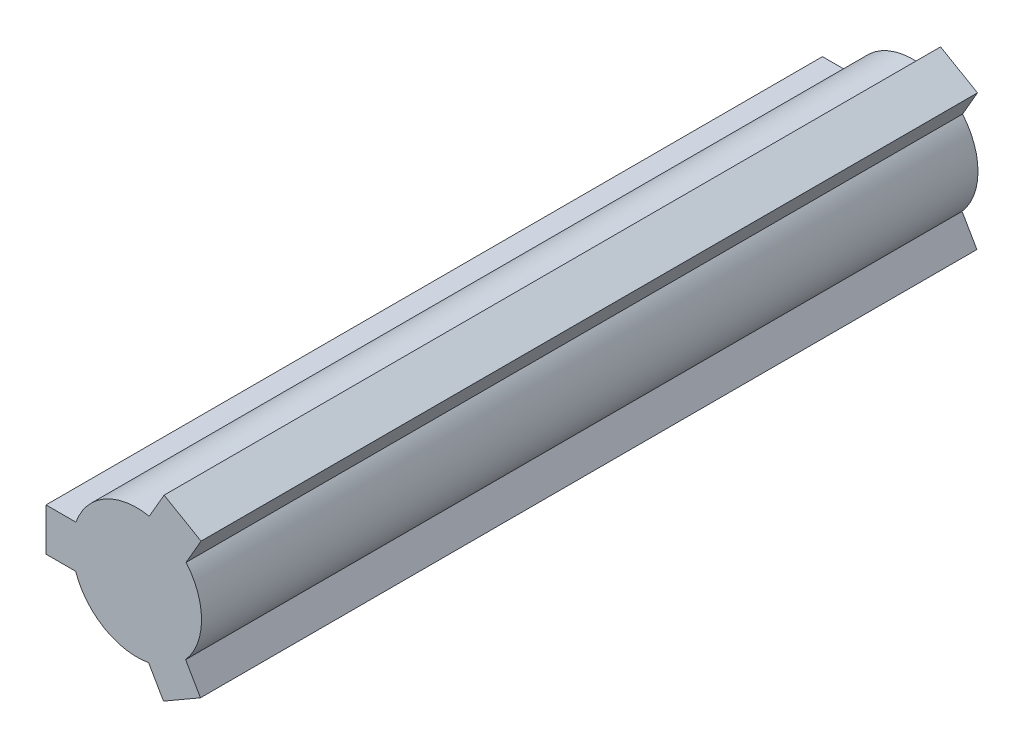
ISO-10303-21;
HEADER;
FILE_DESCRIPTION(('STEP AP214'),'2;1');
FILE_NAME('part.step','',(''),(''),'','','');
FILE_SCHEMA(('AUTOMOTIVE_DESIGN { 1 0 10303 214 1 1 1 1 }'));
ENDSEC;
DATA;
#1=APPLICATION_CONTEXT('core data for automotive mechanical design processes');
#2=APPLICATION_PROTOCOL_DEFINITION('international standard','automotive_design',2000,#1);
#3=PRODUCT_CONTEXT('',#1,'mechanical');
#4=PRODUCT('Part','Part','',(#3));
#5=PRODUCT_RELATED_PRODUCT_CATEGORY('part','',(#4));
#6=PRODUCT_DEFINITION_FORMATION('','',#4);
#7=PRODUCT_DEFINITION_CONTEXT('part definition',#1,'design');
#8=PRODUCT_DEFINITION('design','',#6,#7);
#9=PRODUCT_DEFINITION_SHAPE('','',#8);
#10=(LENGTH_UNIT() NAMED_UNIT(*) SI_UNIT(.MILLI.,.METRE.));
#11=(NAMED_UNIT(*) PLANE_ANGLE_UNIT() SI_UNIT($,.RADIAN.));
#12=(NAMED_UNIT(*) SI_UNIT($,.STERADIAN.) SOLID_ANGLE_UNIT());
#13=UNCERTAINTY_MEASURE_WITH_UNIT(LENGTH_MEASURE(1.E-05),#10,'distance_accuracy_value','');
#14=(GEOMETRIC_REPRESENTATION_CONTEXT(3) GLOBAL_UNCERTAINTY_ASSIGNED_CONTEXT((#13)) GLOBAL_UNIT_ASSIGNED_CONTEXT((#10,
#11,#12)) REPRESENTATION_CONTEXT('',''));
#15=CARTESIAN_POINT('',(0.,0.,0.));
#16=DIRECTION('',(0.,0.,1.));
#17=DIRECTION('',(1.,0.,0.));
#18=AXIS2_PLACEMENT_3D('',#15,#16,#17);
#19=CARTESIAN_POINT('',(0.,0.,38.1));
#20=DIRECTION('',(0.,0.,-1.));
#21=DIRECTION('',(-1.,0.,0.));
#22=AXIS2_PLACEMENT_3D('',#19,#20,#21);
#23=CYLINDRICAL_SURFACE('',#22,3.175);
#24=CARTESIAN_POINT('',(0.,0.,0.));
#25=DIRECTION('',(0.,0.,1.));
#26=DIRECTION('',(1.,0.,0.));
#27=AXIS2_PLACEMENT_3D('',#24,#25,#26);
#28=CIRCLE('',#27,3.175);
#29=CARTESIAN_POINT('',(2.39368220735377,-2.08588362335917,0.));
#30=VERTEX_POINT('',#29);
#31=CARTESIAN_POINT('',(2.41696213486975,2.05886353083585,0.));
#32=VERTEX_POINT('',#31);
#33=EDGE_CURVE('E157',#30,#32,#28,.T.);
#34=ORIENTED_EDGE('',*,*,#33,.T.);
#35=DIRECTION('',(0.,0.,-1.));
#36=VECTOR('',#35,1.);
#37=CARTESIAN_POINT('',(2.41696213486975,2.05886353083585,38.1));
#38=LINE('',#37,#36);
#39=CARTESIAN_POINT('',(2.41696213486975,2.05886353083585,38.1));
#40=VERTEX_POINT('',#39);
#41=EDGE_CURVE('E11',#40,#32,#38,.T.);
#42=ORIENTED_EDGE('',*,*,#41,.F.);
#43=CARTESIAN_POINT('',(0.,0.,38.1));
#44=DIRECTION('',(0.,0.,1.));
#45=DIRECTION('',(1.,0.,0.));
#46=AXIS2_PLACEMENT_3D('',#43,#44,#45);
#47=CIRCLE('',#46,3.175);
#48=CARTESIAN_POINT('',(2.39368220735377,-2.08588362335917,38.1));
#49=VERTEX_POINT('',#48);
#50=EDGE_CURVE('E179',#49,#40,#47,.T.);
#51=ORIENTED_EDGE('',*,*,#50,.F.);
#52=DIRECTION('',(0.,0.,-1.));
#53=VECTOR('',#52,1.);
#54=CARTESIAN_POINT('',(2.39368220735377,-2.08588362335917,38.1));
#55=LINE('',#54,#53);
#56=EDGE_CURVE('E153',#49,#30,#55,.T.);
#57=ORIENTED_EDGE('',*,*,#56,.T.);
#58=EDGE_LOOP('',(#34,#42,#51,#57));
#59=FACE_BOUND('',#58,.T.);
#60=ADVANCED_FACE('F37',(#59),#23,.T.);
#61=CARTESIAN_POINT('',(2.41696213486975,2.05886353083585,38.1));
#62=DIRECTION('',(-0.866025403784438,0.5,0.));
#63=DIRECTION('',(-0.5,-0.866025403784438,0.));
#64=AXIS2_PLACEMENT_3D('',#61,#62,#63);
#65=PLANE('',#64);
#66=DIRECTION('',(0.5,0.866025403784438,0.));
#67=VECTOR('',#66,1.);
#68=CARTESIAN_POINT('',(2.41696213486975,2.05886353083585,0.));
#69=LINE('',#68,#67);
#70=CARTESIAN_POINT('',(3.1501433002469,3.32877056042162,0.));
#71=VERTEX_POINT('',#70);
#72=EDGE_CURVE('E160',#32,#71,#69,.T.);
#73=ORIENTED_EDGE('',*,*,#72,.T.);
#74=DIRECTION('',(0.,0.,-1.));
#75=VECTOR('',#74,1.);
#76=CARTESIAN_POINT('',(3.1501433002469,3.32877056042162,38.1));
#77=LINE('',#76,#75);
#78=CARTESIAN_POINT('',(3.1501433002469,3.32877056042162,38.1));
#79=VERTEX_POINT('',#78);
#80=EDGE_CURVE('E45',#79,#71,#77,.T.);
#81=ORIENTED_EDGE('',*,*,#80,.F.);
#82=DIRECTION('',(0.5,0.866025403784438,0.));
#83=VECTOR('',#82,1.);
#84=CARTESIAN_POINT('',(2.41696213486975,2.05886353083585,38.1));
#85=LINE('',#84,#83);
#86=EDGE_CURVE('E108',#40,#79,#85,.T.);
#87=ORIENTED_EDGE('',*,*,#86,.F.);
#88=ORIENTED_EDGE('',*,*,#41,.T.);
#89=EDGE_LOOP('',(#73,#81,#87,#88));
#90=FACE_BOUND('',#89,.T.);
#91=ADVANCED_FACE('F257',(#90),#65,.F.);
#92=CARTESIAN_POINT('',(3.1501433002469,3.32877056042162,38.1));
#93=DIRECTION('',(-0.5,-0.866025403784439,0.));
#94=DIRECTION('',(0.866025403784439,-0.5,0.));
#95=AXIS2_PLACEMENT_3D('',#92,#93,#94);
#96=PLANE('',#95);
#97=DIRECTION('',(-0.866025403784439,0.5,0.));
#98=VECTOR('',#97,1.);
#99=CARTESIAN_POINT('',(3.1501433002469,3.32877056042162,0.));
#100=LINE('',#99,#98);
#101=CARTESIAN_POINT('',(1.33688820747733,4.37565387634159,0.));
#102=VERTEX_POINT('',#101);
#103=EDGE_CURVE('E162',#71,#102,#100,.T.);
#104=ORIENTED_EDGE('',*,*,#103,.T.);
#105=DIRECTION('',(0.,0.,-1.));
#106=VECTOR('',#105,1.);
#107=CARTESIAN_POINT('',(1.33688820747733,4.37565387634159,38.1));
#108=LINE('',#107,#106);
#109=CARTESIAN_POINT('',(1.33688820747733,4.37565387634159,38.1));
#110=VERTEX_POINT('',#109);
#111=EDGE_CURVE('E198',#110,#102,#108,.T.);
#112=ORIENTED_EDGE('',*,*,#111,.F.);
#113=DIRECTION('',(-0.866025403784439,0.5,0.));
#114=VECTOR('',#113,1.);
#115=CARTESIAN_POINT('',(3.1501433002469,3.32877056042162,38.1));
#116=LINE('',#115,#114);
#117=EDGE_CURVE('E206',#79,#110,#116,.T.);
#118=ORIENTED_EDGE('',*,*,#117,.F.);
#119=ORIENTED_EDGE('',*,*,#80,.T.);
#120=EDGE_LOOP('',(#104,#112,#118,#119));
#121=FACE_BOUND('',#120,.T.);
#122=ADVANCED_FACE('F204',(#121),#96,.F.);
#123=CARTESIAN_POINT('',(1.33688820747733,4.37565387634159,38.1));
#124=DIRECTION('',(0.866025403784438,-0.500000000000001,0.));
#125=DIRECTION('',(0.500000000000001,0.866025403784438,0.));
#126=AXIS2_PLACEMENT_3D('',#123,#124,#125);
#127=PLANE('',#126);
#128=DIRECTION('',(-0.500000000000001,-0.866025403784438,0.));
#129=VECTOR('',#128,1.);
#130=CARTESIAN_POINT('',(1.33688820747733,4.37565387634159,0.));
#131=LINE('',#130,#129);
#132=CARTESIAN_POINT('',(0.609587103490092,3.11593141183476,0.));
#133=VERTEX_POINT('',#132);
#134=EDGE_CURVE('E164',#102,#133,#131,.T.);
#135=ORIENTED_EDGE('',*,*,#134,.T.);
#136=DIRECTION('',(0.,0.,-1.));
#137=VECTOR('',#136,1.);
#138=CARTESIAN_POINT('',(0.609587103490092,3.11593141183476,38.1));
#139=LINE('',#138,#137);
#140=CARTESIAN_POINT('',(0.609587103490092,3.11593141183476,38.1));
#141=VERTEX_POINT('',#140);
#142=EDGE_CURVE('E195',#141,#133,#139,.T.);
#143=ORIENTED_EDGE('',*,*,#142,.F.);
#144=DIRECTION('',(-0.500000000000001,-0.866025403784438,0.));
#145=VECTOR('',#144,1.);
#146=CARTESIAN_POINT('',(1.33688820747733,4.37565387634159,38.1));
#147=LINE('',#146,#145);
#148=EDGE_CURVE('E224',#110,#141,#147,.T.);
#149=ORIENTED_EDGE('',*,*,#148,.F.);
#150=ORIENTED_EDGE('',*,*,#111,.T.);
#151=EDGE_LOOP('',(#135,#143,#149,#150));
#152=FACE_BOUND('',#151,.T.);
#153=ADVANCED_FACE('F215',(#152),#127,.F.);
#154=CARTESIAN_POINT('',(0.,0.,38.1));
#155=DIRECTION('',(0.,0.,-1.));
#156=DIRECTION('',(-1.,0.,0.));
#157=AXIS2_PLACEMENT_3D('',#154,#155,#156);
#158=CYLINDRICAL_SURFACE('',#157,3.175);
#159=CARTESIAN_POINT('',(0.,0.,0.));
#160=DIRECTION('',(0.,0.,1.));
#161=DIRECTION('',(1.,0.,0.));
#162=AXIS2_PLACEMENT_3D('',#159,#160,#161);
#163=CIRCLE('',#162,3.175);
#164=CARTESIAN_POINT('',(-2.99150918806405,1.06371884336435,0.));
#165=VERTEX_POINT('',#164);
#166=EDGE_CURVE('E166',#133,#165,#163,.T.);
#167=ORIENTED_EDGE('',*,*,#166,.T.);
#168=DIRECTION('',(0.,0.,-1.));
#169=VECTOR('',#168,1.);
#170=CARTESIAN_POINT('',(-2.99150918806405,1.06371884336435,38.1));
#171=LINE('',#170,#169);
#172=CARTESIAN_POINT('',(-2.99150918806405,1.06371884336435,38.1));
#173=VERTEX_POINT('',#172);
#174=EDGE_CURVE('E192',#173,#165,#171,.T.);
#175=ORIENTED_EDGE('',*,*,#174,.F.);
#176=CARTESIAN_POINT('',(0.,0.,38.1));
#177=DIRECTION('',(0.,0.,1.));
#178=DIRECTION('',(1.,0.,0.));
#179=AXIS2_PLACEMENT_3D('',#176,#177,#178);
#180=CIRCLE('',#179,3.175);
#181=EDGE_CURVE('E221',#141,#173,#180,.T.);
#182=ORIENTED_EDGE('',*,*,#181,.F.);
#183=ORIENTED_EDGE('',*,*,#142,.T.);
#184=EDGE_LOOP('',(#167,#175,#182,#183));
#185=FACE_BOUND('',#184,.T.);
#186=ADVANCED_FACE('F219',(#185),#158,.T.);
#187=CARTESIAN_POINT('',(-2.99150918806405,1.06371884336435,38.1));
#188=DIRECTION('',(0.,-1.,0.));
#189=DIRECTION('',(1.,0.,0.));
#190=AXIS2_PLACEMENT_3D('',#187,#188,#189);
#191=PLANE('',#190);
#192=DIRECTION('',(-1.,0.,0.));
#193=VECTOR('',#192,1.);
#194=CARTESIAN_POINT('',(-2.99150918806405,1.06371884336435,0.));
#195=LINE('',#194,#193);
#196=CARTESIAN_POINT('',(-4.45787151881833,1.06371884336435,0.));
#197=VERTEX_POINT('',#196);
#198=EDGE_CURVE('E168',#165,#197,#195,.T.);
#199=ORIENTED_EDGE('',*,*,#198,.T.);
#200=DIRECTION('',(0.,0.,-1.));
#201=VECTOR('',#200,1.);
#202=CARTESIAN_POINT('',(-4.45787151881833,1.06371884336435,38.1));
#203=LINE('',#202,#201);
#204=CARTESIAN_POINT('',(-4.45787151881833,1.06371884336435,38.1));
#205=VERTEX_POINT('',#204);
#206=EDGE_CURVE('E189',#205,#197,#203,.T.);
#207=ORIENTED_EDGE('',*,*,#206,.F.);
#208=DIRECTION('',(-1.,0.,0.));
#209=VECTOR('',#208,1.);
#210=CARTESIAN_POINT('',(-2.99150918806405,1.06371884336435,38.1));
#211=LINE('',#210,#209);
#212=EDGE_CURVE('E223',#173,#205,#211,.T.);
#213=ORIENTED_EDGE('',*,*,#212,.F.);
#214=ORIENTED_EDGE('',*,*,#174,.T.);
#215=EDGE_LOOP('',(#199,#207,#213,#214));
#216=FACE_BOUND('',#215,.T.);
#217=ADVANCED_FACE('F270',(#216),#191,.F.);
#218=CARTESIAN_POINT('',(-4.45787151881833,1.06371884336435,38.1));
#219=DIRECTION('',(1.,0.,0.));
#220=DIRECTION('',(0.,0.,-1.));
#221=AXIS2_PLACEMENT_3D('',#218,#219,#220);
#222=PLANE('',#221);
#223=DIRECTION('',(0.,-1.,0.));
#224=VECTOR('',#223,1.);
#225=CARTESIAN_POINT('',(-4.45787151881833,1.06371884336435,0.));
#226=LINE('',#225,#224);
#227=CARTESIAN_POINT('',(-4.45787151881833,-1.03004778847559,0.));
#228=VERTEX_POINT('',#227);
#229=EDGE_CURVE('E170',#197,#228,#226,.T.);
#230=ORIENTED_EDGE('',*,*,#229,.T.);
#231=DIRECTION('',(0.,0.,-1.));
#232=VECTOR('',#231,1.);
#233=CARTESIAN_POINT('',(-4.45787151881833,-1.03004778847559,38.1));
#234=LINE('',#233,#232);
#235=CARTESIAN_POINT('',(-4.45787151881833,-1.03004778847559,38.1));
#236=VERTEX_POINT('',#235);
#237=EDGE_CURVE('E186',#236,#228,#234,.T.);
#238=ORIENTED_EDGE('',*,*,#237,.F.);
#239=DIRECTION('',(0.,-1.,0.));
#240=VECTOR('',#239,1.);
#241=CARTESIAN_POINT('',(-4.45787151881833,1.06371884336435,38.1));
#242=LINE('',#241,#240);
#243=EDGE_CURVE('E226',#205,#236,#242,.T.);
#244=ORIENTED_EDGE('',*,*,#243,.F.);
#245=ORIENTED_EDGE('',*,*,#206,.T.);
#246=EDGE_LOOP('',(#230,#238,#244,#245));
#247=FACE_BOUND('',#246,.T.);
#248=ADVANCED_FACE('F273',(#247),#222,.F.);
#249=CARTESIAN_POINT('',(-4.45787151881833,-1.03004778847559,38.1));
#250=DIRECTION('',(0.,1.,0.));
#251=DIRECTION('',(0.,0.,1.));
#252=AXIS2_PLACEMENT_3D('',#249,#250,#251);
#253=PLANE('',#252);
#254=DIRECTION('',(1.,0.,0.));
#255=VECTOR('',#254,1.);
#256=CARTESIAN_POINT('',(-4.45787151881833,-1.03004778847559,0.));
#257=LINE('',#256,#255);
#258=CARTESIAN_POINT('',(-3.00326931084386,-1.03004778847559,0.));
#259=VERTEX_POINT('',#258);
#260=EDGE_CURVE('E172',#228,#259,#257,.T.);
#261=ORIENTED_EDGE('',*,*,#260,.T.);
#262=DIRECTION('',(0.,0.,-1.));
#263=VECTOR('',#262,1.);
#264=CARTESIAN_POINT('',(-3.00326931084386,-1.03004778847559,38.1));
#265=LINE('',#264,#263);
#266=CARTESIAN_POINT('',(-3.00326931084386,-1.03004778847559,38.1));
#267=VERTEX_POINT('',#266);
#268=EDGE_CURVE('E183',#267,#259,#265,.T.);
#269=ORIENTED_EDGE('',*,*,#268,.F.);
#270=DIRECTION('',(1.,0.,0.));
#271=VECTOR('',#270,1.);
#272=CARTESIAN_POINT('',(-4.45787151881833,-1.03004778847559,38.1));
#273=LINE('',#272,#271);
#274=EDGE_CURVE('E232',#236,#267,#273,.T.);
#275=ORIENTED_EDGE('',*,*,#274,.F.);
#276=ORIENTED_EDGE('',*,*,#237,.T.);
#277=EDGE_LOOP('',(#261,#269,#275,#276));
#278=FACE_BOUND('',#277,.T.);
#279=ADVANCED_FACE('F238',(#278),#253,.F.);
#280=CARTESIAN_POINT('',(0.,0.,38.1));
#281=DIRECTION('',(0.,0.,-1.));
#282=DIRECTION('',(-1.,0.,0.));
#283=AXIS2_PLACEMENT_3D('',#280,#281,#282);
#284=CYLINDRICAL_SURFACE('',#283,3.175);
#285=CARTESIAN_POINT('',(0.,0.,0.));
#286=DIRECTION('',(0.,0.,1.));
#287=DIRECTION('',(1.,0.,0.));
#288=AXIS2_PLACEMENT_3D('',#285,#286,#287);
#289=CIRCLE('',#288,3.175);
#290=CARTESIAN_POINT('',(0.574547053194295,-3.1225823742002,0.));
#291=VERTEX_POINT('',#290);
#292=EDGE_CURVE('E174',#259,#291,#289,.T.);
#293=ORIENTED_EDGE('',*,*,#292,.T.);
#294=DIRECTION('',(0.,0.,-1.));
#295=VECTOR('',#294,1.);
#296=CARTESIAN_POINT('',(0.574547053194295,-3.1225823742002,38.1));
#297=LINE('',#296,#295);
#298=CARTESIAN_POINT('',(0.574547053194295,-3.1225823742002,38.1));
#299=VERTEX_POINT('',#298);
#300=EDGE_CURVE('E148',#299,#291,#297,.T.);
#301=ORIENTED_EDGE('',*,*,#300,.F.);
#302=CARTESIAN_POINT('',(0.,0.,38.1));
#303=DIRECTION('',(0.,0.,1.));
#304=DIRECTION('',(1.,0.,0.));
#305=AXIS2_PLACEMENT_3D('',#302,#303,#304);
#306=CIRCLE('',#305,3.175);
#307=EDGE_CURVE('E139',#267,#299,#306,.T.);
#308=ORIENTED_EDGE('',*,*,#307,.F.);
#309=ORIENTED_EDGE('',*,*,#268,.T.);
#310=EDGE_LOOP('',(#293,#301,#308,#309));
#311=FACE_BOUND('',#310,.T.);
#312=ADVANCED_FACE('F242',(#311),#284,.T.);
#313=CARTESIAN_POINT('',(0.574547053194295,-3.1225823742002,38.1));
#314=DIRECTION('',(0.866025403784439,0.499999999999999,0.));
#315=DIRECTION('',(-0.5,0.866025403784439,0.));
#316=AXIS2_PLACEMENT_3D('',#313,#314,#315);
#317=PLANE('',#316);
#318=DIRECTION('',(0.5,-0.866025403784439,0.));
#319=VECTOR('',#318,1.);
#320=CARTESIAN_POINT('',(0.574547053194295,-3.1225823742002,0.));
#321=LINE('',#320,#319);
#322=CARTESIAN_POINT('',(1.30772821857144,-4.39248940378597,0.));
#323=VERTEX_POINT('',#322);
#324=EDGE_CURVE('E147',#291,#323,#321,.T.);
#325=ORIENTED_EDGE('',*,*,#324,.T.);
#326=DIRECTION('',(0.,0.,-1.));
#327=VECTOR('',#326,1.);
#328=CARTESIAN_POINT('',(1.30772821857144,-4.39248940378597,38.1));
#329=LINE('',#328,#327);
#330=CARTESIAN_POINT('',(1.30772821857144,-4.39248940378597,38.1));
#331=VERTEX_POINT('',#330);
#332=EDGE_CURVE('E144',#331,#323,#329,.T.);
#333=ORIENTED_EDGE('',*,*,#332,.F.);
#334=DIRECTION('',(0.5,-0.866025403784439,0.));
#335=VECTOR('',#334,1.);
#336=CARTESIAN_POINT('',(0.574547053194295,-3.1225823742002,38.1));
#337=LINE('',#336,#335);
#338=EDGE_CURVE('E133',#299,#331,#337,.T.);
#339=ORIENTED_EDGE('',*,*,#338,.F.);
#340=ORIENTED_EDGE('',*,*,#300,.T.);
#341=EDGE_LOOP('',(#325,#333,#339,#340));
#342=FACE_BOUND('',#341,.T.);
#343=ADVANCED_FACE('F145',(#342),#317,.F.);
#344=CARTESIAN_POINT('',(1.30772821857144,-4.39248940378597,38.1));
#345=DIRECTION('',(-0.5,0.866025403784439,0.));
#346=DIRECTION('',(-0.866025403784439,-0.5,0.));
#347=AXIS2_PLACEMENT_3D('',#344,#345,#346);
#348=PLANE('',#347);
#349=DIRECTION('',(0.866025403784439,0.5,0.));
#350=VECTOR('',#349,1.);
#351=CARTESIAN_POINT('',(1.30772821857144,-4.39248940378597,0.));
#352=LINE('',#351,#350);
#353=CARTESIAN_POINT('',(3.120983311341,-3.345606087866,0.));
#354=VERTEX_POINT('',#353);
#355=EDGE_CURVE('E94',#323,#354,#352,.T.);
#356=ORIENTED_EDGE('',*,*,#355,.T.);
#357=DIRECTION('',(0.,0.,-1.));
#358=VECTOR('',#357,1.);
#359=CARTESIAN_POINT('',(3.120983311341,-3.345606087866,38.1));
#360=LINE('',#359,#358);
#361=CARTESIAN_POINT('',(3.120983311341,-3.345606087866,38.1));
#362=VERTEX_POINT('',#361);
#363=EDGE_CURVE('E149',#362,#354,#360,.T.);
#364=ORIENTED_EDGE('',*,*,#363,.F.);
#365=DIRECTION('',(0.866025403784439,0.5,0.));
#366=VECTOR('',#365,1.);
#367=CARTESIAN_POINT('',(1.30772821857144,-4.39248940378597,38.1));
#368=LINE('',#367,#366);
#369=EDGE_CURVE('E137',#331,#362,#368,.T.);
#370=ORIENTED_EDGE('',*,*,#369,.F.);
#371=ORIENTED_EDGE('',*,*,#332,.T.);
#372=EDGE_LOOP('',(#356,#364,#370,#371));
#373=FACE_BOUND('',#372,.T.);
#374=ADVANCED_FACE('F151',(#373),#348,.F.);
#375=CARTESIAN_POINT('',(3.120983311341,-3.345606087866,38.1));
#376=DIRECTION('',(-0.866025403784439,-0.5,0.));
#377=DIRECTION('',(0.5,-0.866025403784439,0.));
#378=AXIS2_PLACEMENT_3D('',#375,#376,#377);
#379=PLANE('',#378);
#380=DIRECTION('',(-0.5,0.866025403784439,0.));
#381=VECTOR('',#380,1.);
#382=CARTESIAN_POINT('',(3.120983311341,-3.345606087866,0.));
#383=LINE('',#382,#381);
#384=EDGE_CURVE('E100',#354,#30,#383,.T.);
#385=ORIENTED_EDGE('',*,*,#384,.T.);
#386=ORIENTED_EDGE('',*,*,#56,.F.);
#387=DIRECTION('',(-0.5,0.866025403784439,0.));
#388=VECTOR('',#387,1.);
#389=CARTESIAN_POINT('',(3.120983311341,-3.345606087866,38.1));
#390=LINE('',#389,#388);
#391=EDGE_CURVE('E53',#362,#49,#390,.T.);
#392=ORIENTED_EDGE('',*,*,#391,.F.);
#393=ORIENTED_EDGE('',*,*,#363,.T.);
#394=EDGE_LOOP('',(#385,#386,#392,#393));
#395=FACE_BOUND('',#394,.T.);
#396=ADVANCED_FACE('F246',(#395),#379,.F.);
#397=CARTESIAN_POINT('',(0.,0.,38.1));
#398=DIRECTION('',(0.,0.,1.));
#399=DIRECTION('',(1.,0.,0.));
#400=AXIS2_PLACEMENT_3D('',#397,#398,#399);
#401=PLANE('',#400);
#402=ORIENTED_EDGE('',*,*,#50,.T.);
#403=ORIENTED_EDGE('',*,*,#86,.T.);
#404=ORIENTED_EDGE('',*,*,#117,.T.);
#405=ORIENTED_EDGE('',*,*,#148,.T.);
#406=ORIENTED_EDGE('',*,*,#181,.T.);
#407=ORIENTED_EDGE('',*,*,#212,.T.);
#408=ORIENTED_EDGE('',*,*,#243,.T.);
#409=ORIENTED_EDGE('',*,*,#274,.T.);
#410=ORIENTED_EDGE('',*,*,#307,.T.);
#411=ORIENTED_EDGE('',*,*,#338,.T.);
#412=ORIENTED_EDGE('',*,*,#369,.T.);
#413=ORIENTED_EDGE('',*,*,#391,.T.);
#414=EDGE_LOOP('',(#402,#403,#404,#405,#406,#407,#408,#409,#410,#411,#412,#413));
#415=FACE_BOUND('',#414,.T.);
#416=ADVANCED_FACE('F135',(#415),#401,.T.);
#417=CARTESIAN_POINT('',(0.,0.,0.));
#418=DIRECTION('',(0.,0.,1.));
#419=DIRECTION('',(1.,0.,0.));
#420=AXIS2_PLACEMENT_3D('',#417,#418,#419);
#421=PLANE('',#420);
#422=ORIENTED_EDGE('',*,*,#33,.F.);
#423=ORIENTED_EDGE('',*,*,#384,.F.);
#424=ORIENTED_EDGE('',*,*,#355,.F.);
#425=ORIENTED_EDGE('',*,*,#324,.F.);
#426=ORIENTED_EDGE('',*,*,#292,.F.);
#427=ORIENTED_EDGE('',*,*,#260,.F.);
#428=ORIENTED_EDGE('',*,*,#229,.F.);
#429=ORIENTED_EDGE('',*,*,#198,.F.);
#430=ORIENTED_EDGE('',*,*,#166,.F.);
#431=ORIENTED_EDGE('',*,*,#134,.F.);
#432=ORIENTED_EDGE('',*,*,#103,.F.);
#433=ORIENTED_EDGE('',*,*,#72,.F.);
#434=EDGE_LOOP('',(#422,#423,#424,#425,#426,#427,#428,#429,#430,#431,#432,#433));
#435=FACE_BOUND('',#434,.T.);
#436=ADVANCED_FACE('F210',(#435),#421,.F.);
#437=CLOSED_SHELL('',(#60,#91,#122,#153,#186,#217,#248,#279,#312,#343,#374,#396,#416,#436));
#438=MANIFOLD_SOLID_BREP('B2',#437);
#439=ADVANCED_BREP_SHAPE_REPRESENTATION('',(#18,#438),#14);
#440=SHAPE_DEFINITION_REPRESENTATION(#9,#439);
ENDSEC;
END-ISO-10303-21;
